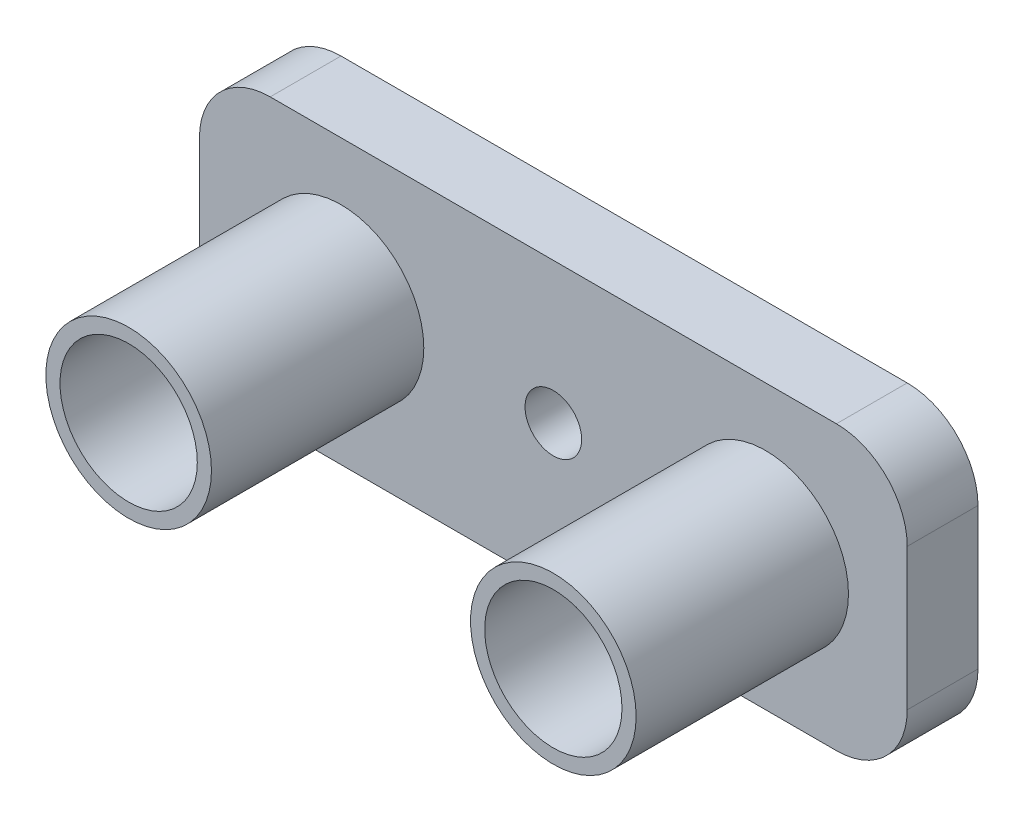
ISO-10303-21;
HEADER;
FILE_DESCRIPTION(('STEP AP214'),'2;1');
FILE_NAME('part.step','',(''),(''),'','','');
FILE_SCHEMA(('AUTOMOTIVE_DESIGN { 1 0 10303 214 1 1 1 1 }'));
ENDSEC;
DATA;
#1=APPLICATION_CONTEXT('core data for automotive mechanical design processes');
#2=APPLICATION_PROTOCOL_DEFINITION('international standard','automotive_design',2000,#1);
#3=PRODUCT_CONTEXT('',#1,'mechanical');
#4=PRODUCT('Part','Part','',(#3));
#5=PRODUCT_RELATED_PRODUCT_CATEGORY('part','',(#4));
#6=PRODUCT_DEFINITION_FORMATION('','',#4);
#7=PRODUCT_DEFINITION_CONTEXT('part definition',#1,'design');
#8=PRODUCT_DEFINITION('design','',#6,#7);
#9=PRODUCT_DEFINITION_SHAPE('','',#8);
#10=(LENGTH_UNIT() NAMED_UNIT(*) SI_UNIT(.MILLI.,.METRE.));
#11=(NAMED_UNIT(*) PLANE_ANGLE_UNIT() SI_UNIT($,.RADIAN.));
#12=(NAMED_UNIT(*) SI_UNIT($,.STERADIAN.) SOLID_ANGLE_UNIT());
#13=UNCERTAINTY_MEASURE_WITH_UNIT(LENGTH_MEASURE(1.E-05),#10,'distance_accuracy_value','');
#14=(GEOMETRIC_REPRESENTATION_CONTEXT(3) GLOBAL_UNCERTAINTY_ASSIGNED_CONTEXT((#13)) GLOBAL_UNIT_ASSIGNED_CONTEXT((#10,
#11,#12)) REPRESENTATION_CONTEXT('',''));
#15=CARTESIAN_POINT('',(0.,0.,0.));
#16=DIRECTION('',(0.,0.,1.));
#17=DIRECTION('',(1.,0.,0.));
#18=AXIS2_PLACEMENT_3D('',#15,#16,#17);
#19=CARTESIAN_POINT('',(0.,-0.954545454545454,5.));
#20=DIRECTION('',(0.,1.,0.));
#21=DIRECTION('',(0.,0.,1.));
#22=AXIS2_PLACEMENT_3D('',#19,#20,#21);
#23=PLANE('',#22);
#24=DIRECTION('',(1.,0.,0.));
#25=VECTOR('',#24,1.);
#26=CARTESIAN_POINT('',(0.,-0.954545454545454,0.));
#27=LINE('',#26,#25);
#28=CARTESIAN_POINT('',(3.11676106102587,-0.954545454545454,0.));
#29=VERTEX_POINT('',#28);
#30=CARTESIAN_POINT('',(42.9696969696969,-0.954545454545454,0.));
#31=VERTEX_POINT('',#30);
#32=EDGE_CURVE('E219',#29,#31,#27,.T.);
#33=ORIENTED_EDGE('',*,*,#32,.T.);
#34=DIRECTION('',(0.,0.,-1.));
#35=VECTOR('',#34,1.);
#36=CARTESIAN_POINT('',(42.9696969696969,-0.954545454545454,5.));
#37=LINE('',#36,#35);
#38=CARTESIAN_POINT('',(42.9696969696969,-0.954545454545454,5.));
#39=VERTEX_POINT('',#38);
#40=EDGE_CURVE('E256',#39,#31,#37,.T.);
#41=ORIENTED_EDGE('',*,*,#40,.F.);
#42=DIRECTION('',(1.,0.,0.));
#43=VECTOR('',#42,1.);
#44=CARTESIAN_POINT('',(0.,-0.954545454545454,5.));
#45=LINE('',#44,#43);
#46=CARTESIAN_POINT('',(3.11676106102587,-0.954545454545454,5.));
#47=VERTEX_POINT('',#46);
#48=EDGE_CURVE('E286',#47,#39,#45,.T.);
#49=ORIENTED_EDGE('',*,*,#48,.F.);
#50=DIRECTION('',(0.,0.,-1.));
#51=VECTOR('',#50,1.);
#52=CARTESIAN_POINT('',(3.11676106102587,-0.954545454545454,5.));
#53=LINE('',#52,#51);
#54=EDGE_CURVE('E165',#47,#29,#53,.T.);
#55=ORIENTED_EDGE('',*,*,#54,.T.);
#56=EDGE_LOOP('',(#33,#41,#49,#55));
#57=FACE_BOUND('',#56,.T.);
#58=ADVANCED_FACE('F107',(#57),#23,.F.);
#59=CARTESIAN_POINT('',(42.969696969697,4.04545454545455,5.));
#60=DIRECTION('',(0.,0.,-1.));
#61=DIRECTION('',(-1.,0.,0.));
#62=AXIS2_PLACEMENT_3D('',#59,#60,#61);
#63=CYLINDRICAL_SURFACE('',#62,5.);
#64=CARTESIAN_POINT('',(42.969696969697,4.04545454545455,0.));
#65=DIRECTION('',(0.,0.,1.));
#66=DIRECTION('',(1.,0.,0.));
#67=AXIS2_PLACEMENT_3D('',#64,#65,#66);
#68=CIRCLE('',#67,5.);
#69=CARTESIAN_POINT('',(47.969696969697,4.04545454545458,0.));
#70=VERTEX_POINT('',#69);
#71=EDGE_CURVE('E223',#70,#31,#68,.F.);
#72=ORIENTED_EDGE('',*,*,#71,.F.);
#73=DIRECTION('',(0.,0.,-1.));
#74=VECTOR('',#73,1.);
#75=CARTESIAN_POINT('',(47.969696969697,4.04545454545458,5.));
#76=LINE('',#75,#74);
#77=CARTESIAN_POINT('',(47.969696969697,4.04545454545458,5.));
#78=VERTEX_POINT('',#77);
#79=EDGE_CURVE('E253',#78,#70,#76,.T.);
#80=ORIENTED_EDGE('',*,*,#79,.F.);
#81=CARTESIAN_POINT('',(42.969696969697,4.04545454545455,5.));
#82=DIRECTION('',(0.,0.,1.));
#83=DIRECTION('',(1.,0.,0.));
#84=AXIS2_PLACEMENT_3D('',#81,#82,#83);
#85=CIRCLE('',#84,5.);
#86=EDGE_CURVE('E289',#78,#39,#85,.F.);
#87=ORIENTED_EDGE('',*,*,#86,.T.);
#88=ORIENTED_EDGE('',*,*,#40,.T.);
#89=EDGE_LOOP('',(#72,#80,#87,#88));
#90=FACE_BOUND('',#89,.T.);
#91=ADVANCED_FACE('F304',(#90),#63,.T.);
#92=CARTESIAN_POINT('',(47.969696969697,0.,5.));
#93=DIRECTION('',(1.,0.,0.));
#94=DIRECTION('',(0.,0.,-1.));
#95=AXIS2_PLACEMENT_3D('',#92,#93,#94);
#96=PLANE('',#95);
#97=DIRECTION('',(0.,-1.,0.));
#98=VECTOR('',#97,1.);
#99=CARTESIAN_POINT('',(47.969696969697,0.,0.));
#100=LINE('',#99,#98);
#101=CARTESIAN_POINT('',(47.969696969697,14.0454545454545,0.));
#102=VERTEX_POINT('',#101);
#103=EDGE_CURVE('E227',#102,#70,#100,.T.);
#104=ORIENTED_EDGE('',*,*,#103,.F.);
#105=DIRECTION('',(0.,0.,-1.));
#106=VECTOR('',#105,1.);
#107=CARTESIAN_POINT('',(47.969696969697,14.0454545454545,5.));
#108=LINE('',#107,#106);
#109=CARTESIAN_POINT('',(47.969696969697,14.0454545454545,5.));
#110=VERTEX_POINT('',#109);
#111=EDGE_CURVE('E250',#110,#102,#108,.T.);
#112=ORIENTED_EDGE('',*,*,#111,.F.);
#113=DIRECTION('',(0.,-1.,0.));
#114=VECTOR('',#113,1.);
#115=CARTESIAN_POINT('',(47.969696969697,0.,5.));
#116=LINE('',#115,#114);
#117=EDGE_CURVE('E293',#110,#78,#116,.T.);
#118=ORIENTED_EDGE('',*,*,#117,.T.);
#119=ORIENTED_EDGE('',*,*,#79,.T.);
#120=EDGE_LOOP('',(#104,#112,#118,#119));
#121=FACE_BOUND('',#120,.T.);
#122=ADVANCED_FACE('F299',(#121),#96,.T.);
#123=CARTESIAN_POINT('',(42.969696969697,14.0454545454545,5.));
#124=DIRECTION('',(0.,0.,-1.));
#125=DIRECTION('',(-1.,0.,0.));
#126=AXIS2_PLACEMENT_3D('',#123,#124,#125);
#127=CYLINDRICAL_SURFACE('',#126,5.);
#128=CARTESIAN_POINT('',(42.969696969697,14.0454545454545,0.));
#129=DIRECTION('',(0.,0.,1.));
#130=DIRECTION('',(1.,0.,0.));
#131=AXIS2_PLACEMENT_3D('',#128,#129,#130);
#132=CIRCLE('',#131,5.);
#133=CARTESIAN_POINT('',(42.9696969696969,19.0454545454545,0.));
#134=VERTEX_POINT('',#133);
#135=EDGE_CURVE('E231',#102,#134,#132,.T.);
#136=ORIENTED_EDGE('',*,*,#135,.T.);
#137=DIRECTION('',(0.,0.,-1.));
#138=VECTOR('',#137,1.);
#139=CARTESIAN_POINT('',(42.9696969696969,19.0454545454545,5.));
#140=LINE('',#139,#138);
#141=CARTESIAN_POINT('',(42.9696969696969,19.0454545454545,5.));
#142=VERTEX_POINT('',#141);
#143=EDGE_CURVE('E193',#142,#134,#140,.T.);
#144=ORIENTED_EDGE('',*,*,#143,.F.);
#145=CARTESIAN_POINT('',(42.969696969697,14.0454545454545,5.));
#146=DIRECTION('',(0.,0.,1.));
#147=DIRECTION('',(1.,0.,0.));
#148=AXIS2_PLACEMENT_3D('',#145,#146,#147);
#149=CIRCLE('',#148,5.);
#150=EDGE_CURVE('E199',#110,#142,#149,.T.);
#151=ORIENTED_EDGE('',*,*,#150,.F.);
#152=ORIENTED_EDGE('',*,*,#111,.T.);
#153=EDGE_LOOP('',(#136,#144,#151,#152));
#154=FACE_BOUND('',#153,.T.);
#155=ADVANCED_FACE('F310',(#154),#127,.T.);
#156=CARTESIAN_POINT('',(0.,19.0454545454545,5.));
#157=DIRECTION('',(0.,1.,0.));
#158=DIRECTION('',(0.,0.,1.));
#159=AXIS2_PLACEMENT_3D('',#156,#157,#158);
#160=PLANE('',#159);
#161=DIRECTION('',(1.,0.,0.));
#162=VECTOR('',#161,1.);
#163=CARTESIAN_POINT('',(0.,19.0454545454545,0.));
#164=LINE('',#163,#162);
#165=CARTESIAN_POINT('',(2.969696969697,19.0454545454545,0.));
#166=VERTEX_POINT('',#165);
#167=EDGE_CURVE('E187',#166,#134,#164,.T.);
#168=ORIENTED_EDGE('',*,*,#167,.F.);
#169=DIRECTION('',(0.,0.,-1.));
#170=VECTOR('',#169,1.);
#171=CARTESIAN_POINT('',(2.969696969697,19.0454545454545,5.));
#172=LINE('',#171,#170);
#173=CARTESIAN_POINT('',(2.969696969697,19.0454545454545,5.));
#174=VERTEX_POINT('',#173);
#175=EDGE_CURVE('E182',#174,#166,#172,.T.);
#176=ORIENTED_EDGE('',*,*,#175,.F.);
#177=DIRECTION('',(1.,0.,0.));
#178=VECTOR('',#177,1.);
#179=CARTESIAN_POINT('',(0.,19.0454545454545,5.));
#180=LINE('',#179,#178);
#181=EDGE_CURVE('E185',#174,#142,#180,.T.);
#182=ORIENTED_EDGE('',*,*,#181,.T.);
#183=ORIENTED_EDGE('',*,*,#143,.T.);
#184=EDGE_LOOP('',(#168,#176,#182,#183));
#185=FACE_BOUND('',#184,.T.);
#186=ADVANCED_FACE('F184',(#185),#160,.T.);
#187=CARTESIAN_POINT('',(2.96969696969697,14.0454545454545,5.));
#188=DIRECTION('',(0.,0.,-1.));
#189=DIRECTION('',(-1.,0.,0.));
#190=AXIS2_PLACEMENT_3D('',#187,#188,#189);
#191=CYLINDRICAL_SURFACE('',#190,5.);
#192=CARTESIAN_POINT('',(2.96969696969697,14.0454545454545,0.));
#193=DIRECTION('',(0.,0.,1.));
#194=DIRECTION('',(1.,0.,0.));
#195=AXIS2_PLACEMENT_3D('',#192,#193,#194);
#196=CIRCLE('',#195,5.);
#197=CARTESIAN_POINT('',(-2.03030303030303,14.0454545454545,0.));
#198=VERTEX_POINT('',#197);
#199=EDGE_CURVE('E237',#198,#166,#196,.F.);
#200=ORIENTED_EDGE('',*,*,#199,.F.);
#201=DIRECTION('',(0.,0.,-1.));
#202=VECTOR('',#201,1.);
#203=CARTESIAN_POINT('',(-2.03030303030303,14.0454545454545,5.));
#204=LINE('',#203,#202);
#205=CARTESIAN_POINT('',(-2.03030303030303,14.0454545454545,5.));
#206=VERTEX_POINT('',#205);
#207=EDGE_CURVE('E154',#206,#198,#204,.T.);
#208=ORIENTED_EDGE('',*,*,#207,.F.);
#209=CARTESIAN_POINT('',(2.96969696969697,14.0454545454545,5.));
#210=DIRECTION('',(0.,0.,1.));
#211=DIRECTION('',(1.,0.,0.));
#212=AXIS2_PLACEMENT_3D('',#209,#210,#211);
#213=CIRCLE('',#212,5.);
#214=EDGE_CURVE('E196',#206,#174,#213,.F.);
#215=ORIENTED_EDGE('',*,*,#214,.T.);
#216=ORIENTED_EDGE('',*,*,#175,.T.);
#217=EDGE_LOOP('',(#200,#208,#215,#216));
#218=FACE_BOUND('',#217,.T.);
#219=ADVANCED_FACE('F203',(#218),#191,.T.);
#220=CARTESIAN_POINT('',(-2.03030303030303,0.,5.));
#221=DIRECTION('',(1.,0.,0.));
#222=DIRECTION('',(0.,1.,0.));
#223=AXIS2_PLACEMENT_3D('',#220,#221,#222);
#224=PLANE('',#223);
#225=DIRECTION('',(0.,-1.,0.));
#226=VECTOR('',#225,1.);
#227=CARTESIAN_POINT('',(-2.03030303030303,0.,0.));
#228=LINE('',#227,#226);
#229=CARTESIAN_POINT('',(-2.03030303030303,4.19251863678344,0.));
#230=VERTEX_POINT('',#229);
#231=EDGE_CURVE('E240',#198,#230,#228,.T.);
#232=ORIENTED_EDGE('',*,*,#231,.T.);
#233=DIRECTION('',(0.,0.,-1.));
#234=VECTOR('',#233,1.);
#235=CARTESIAN_POINT('',(-2.03030303030303,4.19251863678344,5.));
#236=LINE('',#235,#234);
#237=CARTESIAN_POINT('',(-2.03030303030303,4.19251863678344,5.));
#238=VERTEX_POINT('',#237);
#239=EDGE_CURVE('E161',#238,#230,#236,.T.);
#240=ORIENTED_EDGE('',*,*,#239,.F.);
#241=DIRECTION('',(0.,-1.,0.));
#242=VECTOR('',#241,1.);
#243=CARTESIAN_POINT('',(-2.03030303030303,0.,5.));
#244=LINE('',#243,#242);
#245=EDGE_CURVE('E126',#206,#238,#244,.T.);
#246=ORIENTED_EDGE('',*,*,#245,.F.);
#247=ORIENTED_EDGE('',*,*,#207,.T.);
#248=EDGE_LOOP('',(#232,#240,#246,#247));
#249=FACE_BOUND('',#248,.T.);
#250=ADVANCED_FACE('F328',(#249),#224,.F.);
#251=CARTESIAN_POINT('',(3.11676106102583,4.19251863678341,5.));
#252=DIRECTION('',(0.,0.,-1.));
#253=DIRECTION('',(-1.,0.,0.));
#254=AXIS2_PLACEMENT_3D('',#251,#252,#253);
#255=CYLINDRICAL_SURFACE('',#254,5.14706409132886);
#256=CARTESIAN_POINT('',(3.11676106102583,4.19251863678341,0.));
#257=DIRECTION('',(0.,0.,1.));
#258=DIRECTION('',(1.,0.,0.));
#259=AXIS2_PLACEMENT_3D('',#256,#257,#258);
#260=CIRCLE('',#259,5.14706409132886);
#261=EDGE_CURVE('E214',#29,#230,#260,.F.);
#262=ORIENTED_EDGE('',*,*,#261,.F.);
#263=ORIENTED_EDGE('',*,*,#54,.F.);
#264=CARTESIAN_POINT('',(3.11676106102583,4.19251863678341,5.));
#265=DIRECTION('',(0.,0.,1.));
#266=DIRECTION('',(1.,0.,0.));
#267=AXIS2_PLACEMENT_3D('',#264,#265,#266);
#268=CIRCLE('',#267,5.14706409132886);
#269=EDGE_CURVE('E283',#47,#238,#268,.F.);
#270=ORIENTED_EDGE('',*,*,#269,.T.);
#271=ORIENTED_EDGE('',*,*,#239,.T.);
#272=EDGE_LOOP('',(#262,#263,#270,#271));
#273=FACE_BOUND('',#272,.T.);
#274=ADVANCED_FACE('F326',(#273),#255,.T.);
#275=CARTESIAN_POINT('',(22.969696969697,9.08222056828676,5.));
#276=DIRECTION('',(0.,0.,-1.));
#277=DIRECTION('',(-1.,0.,0.));
#278=AXIS2_PLACEMENT_3D('',#275,#276,#277);
#279=CYLINDRICAL_SURFACE('',#278,2.);
#280=CARTESIAN_POINT('',(22.969696969697,9.08222056828676,5.));
#281=DIRECTION('',(0.,0.,1.));
#282=DIRECTION('',(1.,0.,0.));
#283=AXIS2_PLACEMENT_3D('',#280,#281,#282);
#284=CIRCLE('',#283,2.);
#285=CARTESIAN_POINT('',(24.969696969697,9.08222056828676,5.));
#286=VERTEX_POINT('',#285);
#287=EDGE_CURVE('E243',#286,#286,#284,.T.);
#288=ORIENTED_EDGE('',*,*,#287,.T.);
#289=EDGE_LOOP('',(#288));
#290=FACE_BOUND('',#289,.T.);
#291=CARTESIAN_POINT('',(22.969696969697,9.08222056828676,0.));
#292=DIRECTION('',(0.,0.,1.));
#293=DIRECTION('',(1.,0.,0.));
#294=AXIS2_PLACEMENT_3D('',#291,#292,#293);
#295=CIRCLE('',#294,2.);
#296=CARTESIAN_POINT('',(24.969696969697,9.08222056828676,0.));
#297=VERTEX_POINT('',#296);
#298=EDGE_CURVE('E210',#297,#297,#295,.T.);
#299=ORIENTED_EDGE('',*,*,#298,.F.);
#300=EDGE_LOOP('',(#299));
#301=FACE_BOUND('',#300,.T.);
#302=ADVANCED_FACE('F109',(#290,#301),#279,.F.);
#303=CARTESIAN_POINT('',(0.,0.,0.));
#304=DIRECTION('',(0.,0.,1.));
#305=DIRECTION('',(1.,0.,0.));
#306=AXIS2_PLACEMENT_3D('',#303,#304,#305);
#307=PLANE('',#306);
#308=ORIENTED_EDGE('',*,*,#298,.T.);
#309=EDGE_LOOP('',(#308));
#310=FACE_BOUND('',#309,.T.);
#311=ORIENTED_EDGE('',*,*,#261,.T.);
#312=ORIENTED_EDGE('',*,*,#231,.F.);
#313=ORIENTED_EDGE('',*,*,#199,.T.);
#314=ORIENTED_EDGE('',*,*,#167,.T.);
#315=ORIENTED_EDGE('',*,*,#135,.F.);
#316=ORIENTED_EDGE('',*,*,#103,.T.);
#317=ORIENTED_EDGE('',*,*,#71,.T.);
#318=ORIENTED_EDGE('',*,*,#32,.F.);
#319=EDGE_LOOP('',(#311,#312,#313,#314,#315,#316,#317,#318));
#320=FACE_BOUND('',#319,.T.);
#321=ADVANCED_FACE('F308',(#310,#320),#307,.F.);
#322=CARTESIAN_POINT('',(0.,0.,5.));
#323=DIRECTION('',(0.,0.,1.));
#324=DIRECTION('',(1.,0.,0.));
#325=AXIS2_PLACEMENT_3D('',#322,#323,#324);
#326=PLANE('',#325);
#327=CARTESIAN_POINT('',(37.969696969697,9.06016095458743,5.));
#328=DIRECTION('',(0.,0.,1.));
#329=DIRECTION('',(1.,0.,0.));
#330=AXIS2_PLACEMENT_3D('',#327,#328,#329);
#331=CIRCLE('',#330,5.85);
#332=CARTESIAN_POINT('',(43.819696969697,9.06016095458743,5.));
#333=VERTEX_POINT('',#332);
#334=EDGE_CURVE('E111',#333,#333,#331,.F.);
#335=ORIENTED_EDGE('',*,*,#334,.T.);
#336=EDGE_LOOP('',(#335));
#337=FACE_BOUND('',#336,.T.);
#338=CARTESIAN_POINT('',(7.96968615579103,9.10428019788946,5.));
#339=DIRECTION('',(0.,0.,1.));
#340=DIRECTION('',(1.,0.,0.));
#341=AXIS2_PLACEMENT_3D('',#338,#339,#340);
#342=CIRCLE('',#341,5.85);
#343=CARTESIAN_POINT('',(13.819686155791,9.10428019788946,5.));
#344=VERTEX_POINT('',#343);
#345=EDGE_CURVE('E215',#344,#344,#342,.F.);
#346=ORIENTED_EDGE('',*,*,#345,.T.);
#347=EDGE_LOOP('',(#346));
#348=FACE_BOUND('',#347,.T.);
#349=ORIENTED_EDGE('',*,*,#287,.F.);
#350=EDGE_LOOP('',(#349));
#351=FACE_BOUND('',#350,.T.);
#352=ORIENTED_EDGE('',*,*,#269,.F.);
#353=ORIENTED_EDGE('',*,*,#48,.T.);
#354=ORIENTED_EDGE('',*,*,#86,.F.);
#355=ORIENTED_EDGE('',*,*,#117,.F.);
#356=ORIENTED_EDGE('',*,*,#150,.T.);
#357=ORIENTED_EDGE('',*,*,#181,.F.);
#358=ORIENTED_EDGE('',*,*,#214,.F.);
#359=ORIENTED_EDGE('',*,*,#245,.T.);
#360=EDGE_LOOP('',(#352,#353,#354,#355,#356,#357,#358,#359));
#361=FACE_BOUND('',#360,.T.);
#362=ADVANCED_FACE('F195',(#337,#348,#351,#361),#326,.T.);
#363=CARTESIAN_POINT('',(7.96968615579103,9.10428019788946,20.));
#364=DIRECTION('',(0.,0.,1.));
#365=DIRECTION('',(1.,0.,0.));
#366=AXIS2_PLACEMENT_3D('',#363,#364,#365);
#367=PLANE('',#366);
#368=CARTESIAN_POINT('',(7.96968615579103,9.10428019788946,20.));
#369=DIRECTION('',(0.,0.,1.));
#370=DIRECTION('',(1.,0.,0.));
#371=AXIS2_PLACEMENT_3D('',#368,#369,#370);
#372=CIRCLE('',#371,5.85);
#373=CARTESIAN_POINT('',(13.819686155791,9.10428019788946,20.));
#374=VERTEX_POINT('',#373);
#375=EDGE_CURVE('E266',#374,#374,#372,.T.);
#376=ORIENTED_EDGE('',*,*,#375,.T.);
#377=EDGE_LOOP('',(#376));
#378=FACE_BOUND('',#377,.T.);
#379=CARTESIAN_POINT('',(7.96968615579103,9.10428019788946,20.));
#380=DIRECTION('',(0.,0.,1.));
#381=DIRECTION('',(1.,0.,0.));
#382=AXIS2_PLACEMENT_3D('',#379,#380,#381);
#383=CIRCLE('',#382,4.85);
#384=CARTESIAN_POINT('',(12.819686155791,9.10428019788946,20.));
#385=VERTEX_POINT('',#384);
#386=EDGE_CURVE('E271',#385,#385,#383,.T.);
#387=ORIENTED_EDGE('',*,*,#386,.F.);
#388=EDGE_LOOP('',(#387));
#389=FACE_BOUND('',#388,.T.);
#390=ADVANCED_FACE('F345',(#378,#389),#367,.T.);
#391=CARTESIAN_POINT('',(7.96968615579103,9.10428019788946,20.));
#392=DIRECTION('',(0.,0.,-1.));
#393=DIRECTION('',(-1.,0.,0.));
#394=AXIS2_PLACEMENT_3D('',#391,#392,#393);
#395=CYLINDRICAL_SURFACE('',#394,5.85);
#396=ORIENTED_EDGE('',*,*,#345,.F.);
#397=EDGE_LOOP('',(#396));
#398=FACE_BOUND('',#397,.T.);
#399=ORIENTED_EDGE('',*,*,#375,.F.);
#400=EDGE_LOOP('',(#399));
#401=FACE_BOUND('',#400,.T.);
#402=ADVANCED_FACE('F349',(#398,#401),#395,.T.);
#403=CARTESIAN_POINT('',(7.96968615579103,9.10428019788946,20.));
#404=DIRECTION('',(0.,0.,-1.));
#405=DIRECTION('',(-1.,0.,0.));
#406=AXIS2_PLACEMENT_3D('',#403,#404,#405);
#407=CYLINDRICAL_SURFACE('',#406,4.85);
#408=CARTESIAN_POINT('',(7.96968615579103,9.10428019788946,5.));
#409=DIRECTION('',(0.,0.,1.));
#410=DIRECTION('',(1.,0.,0.));
#411=AXIS2_PLACEMENT_3D('',#408,#409,#410);
#412=CIRCLE('',#411,4.85);
#413=CARTESIAN_POINT('',(12.819686155791,9.10428019788946,5.));
#414=VERTEX_POINT('',#413);
#415=EDGE_CURVE('E118',#414,#414,#412,.F.);
#416=ORIENTED_EDGE('',*,*,#415,.T.);
#417=EDGE_LOOP('',(#416));
#418=FACE_BOUND('',#417,.T.);
#419=ORIENTED_EDGE('',*,*,#386,.T.);
#420=EDGE_LOOP('',(#419));
#421=FACE_BOUND('',#420,.T.);
#422=ADVANCED_FACE('F352',(#418,#421),#407,.F.);
#423=ORIENTED_EDGE('',*,*,#415,.F.);
#424=EDGE_LOOP('',(#423));
#425=FACE_BOUND('',#424,.T.);
#426=ADVANCED_FACE('F348',(#425),#326,.T.);
#427=CARTESIAN_POINT('',(37.969696969697,9.06016095458743,20.));
#428=DIRECTION('',(0.,0.,1.));
#429=DIRECTION('',(1.,0.,0.));
#430=AXIS2_PLACEMENT_3D('',#427,#428,#429);
#431=PLANE('',#430);
#432=CARTESIAN_POINT('',(37.969696969697,9.06016095458743,20.));
#433=DIRECTION('',(0.,0.,1.));
#434=DIRECTION('',(1.,0.,0.));
#435=AXIS2_PLACEMENT_3D('',#432,#433,#434);
#436=CIRCLE('',#435,5.85);
#437=CARTESIAN_POINT('',(43.819696969697,9.06016095458743,20.));
#438=VERTEX_POINT('',#437);
#439=EDGE_CURVE('E377',#438,#438,#436,.T.);
#440=ORIENTED_EDGE('',*,*,#439,.T.);
#441=EDGE_LOOP('',(#440));
#442=FACE_BOUND('',#441,.T.);
#443=CARTESIAN_POINT('',(37.969696969697,9.06016095458743,20.));
#444=DIRECTION('',(0.,0.,1.));
#445=DIRECTION('',(1.,0.,0.));
#446=AXIS2_PLACEMENT_3D('',#443,#444,#445);
#447=CIRCLE('',#446,4.85);
#448=CARTESIAN_POINT('',(42.819696969697,9.06016095458743,20.));
#449=VERTEX_POINT('',#448);
#450=EDGE_CURVE('E379',#449,#449,#447,.T.);
#451=ORIENTED_EDGE('',*,*,#450,.F.);
#452=EDGE_LOOP('',(#451));
#453=FACE_BOUND('',#452,.T.);
#454=ADVANCED_FACE('F364',(#442,#453),#431,.T.);
#455=CARTESIAN_POINT('',(37.969696969697,9.06016095458743,20.));
#456=DIRECTION('',(0.,0.,-1.));
#457=DIRECTION('',(-1.,0.,0.));
#458=AXIS2_PLACEMENT_3D('',#455,#456,#457);
#459=CYLINDRICAL_SURFACE('',#458,5.85);
#460=ORIENTED_EDGE('',*,*,#334,.F.);
#461=EDGE_LOOP('',(#460));
#462=FACE_BOUND('',#461,.T.);
#463=ORIENTED_EDGE('',*,*,#439,.F.);
#464=EDGE_LOOP('',(#463));
#465=FACE_BOUND('',#464,.T.);
#466=ADVANCED_FACE('F362',(#462,#465),#459,.T.);
#467=CARTESIAN_POINT('',(37.969696969697,9.06016095458743,20.));
#468=DIRECTION('',(0.,0.,-1.));
#469=DIRECTION('',(-1.,0.,0.));
#470=AXIS2_PLACEMENT_3D('',#467,#468,#469);
#471=CYLINDRICAL_SURFACE('',#470,4.85);
#472=CARTESIAN_POINT('',(37.969696969697,9.06016095458743,5.));
#473=DIRECTION('',(0.,0.,1.));
#474=DIRECTION('',(1.,0.,0.));
#475=AXIS2_PLACEMENT_3D('',#472,#473,#474);
#476=CIRCLE('',#475,4.85);
#477=CARTESIAN_POINT('',(42.819696969697,9.06016095458743,5.));
#478=VERTEX_POINT('',#477);
#479=EDGE_CURVE('E12',#478,#478,#476,.F.);
#480=ORIENTED_EDGE('',*,*,#479,.T.);
#481=EDGE_LOOP('',(#480));
#482=FACE_BOUND('',#481,.T.);
#483=ORIENTED_EDGE('',*,*,#450,.T.);
#484=EDGE_LOOP('',(#483));
#485=FACE_BOUND('',#484,.T.);
#486=ADVANCED_FACE('F359',(#482,#485),#471,.F.);
#487=ORIENTED_EDGE('',*,*,#479,.F.);
#488=EDGE_LOOP('',(#487));
#489=FACE_BOUND('',#488,.T.);
#490=ADVANCED_FACE('F347',(#489),#326,.T.);
#491=CLOSED_SHELL('',(#58,#91,#122,#155,#186,#219,#250,#274,#302,#321,#362,#390,#402,#422,#426,
#454,#466,#486,#490));
#492=MANIFOLD_SOLID_BREP('B2',#491);
#493=ADVANCED_BREP_SHAPE_REPRESENTATION('',(#18,#492),#14);
#494=SHAPE_DEFINITION_REPRESENTATION(#9,#493);
ENDSEC;
END-ISO-10303-21;
